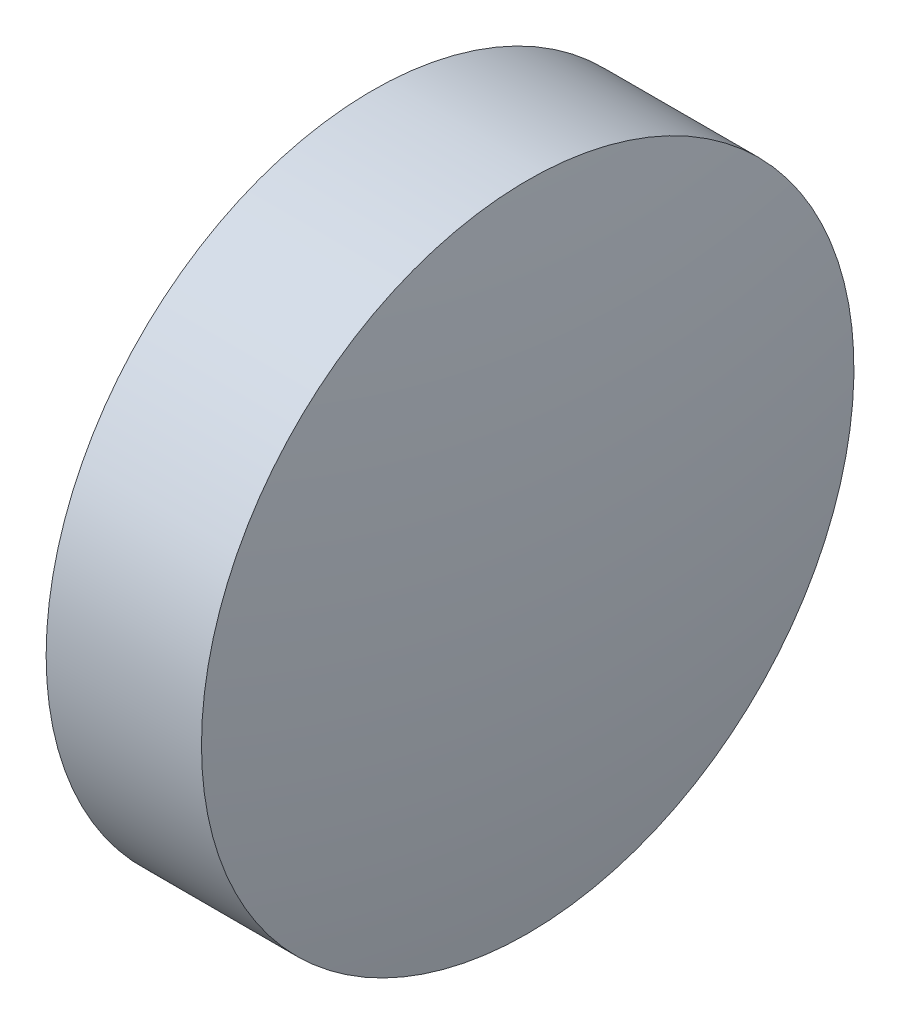
ISO-10303-21;
HEADER;
FILE_DESCRIPTION(('STEP AP214'),'2;1');
FILE_NAME('part.step','',(''),(''),'','','');
FILE_SCHEMA(('AUTOMOTIVE_DESIGN { 1 0 10303 214 1 1 1 1 }'));
ENDSEC;
DATA;
#1=APPLICATION_CONTEXT('core data for automotive mechanical design processes');
#2=APPLICATION_PROTOCOL_DEFINITION('international standard','automotive_design',2000,#1);
#3=PRODUCT_CONTEXT('',#1,'mechanical');
#4=PRODUCT('Part','Part','',(#3));
#5=PRODUCT_RELATED_PRODUCT_CATEGORY('part','',(#4));
#6=PRODUCT_DEFINITION_FORMATION('','',#4);
#7=PRODUCT_DEFINITION_CONTEXT('part definition',#1,'design');
#8=PRODUCT_DEFINITION('design','',#6,#7);
#9=PRODUCT_DEFINITION_SHAPE('','',#8);
#10=(LENGTH_UNIT() NAMED_UNIT(*) SI_UNIT(.MILLI.,.METRE.));
#11=(NAMED_UNIT(*) PLANE_ANGLE_UNIT() SI_UNIT($,.RADIAN.));
#12=(NAMED_UNIT(*) SI_UNIT($,.STERADIAN.) SOLID_ANGLE_UNIT());
#13=UNCERTAINTY_MEASURE_WITH_UNIT(LENGTH_MEASURE(1.E-05),#10,'distance_accuracy_value','');
#14=(GEOMETRIC_REPRESENTATION_CONTEXT(3) GLOBAL_UNCERTAINTY_ASSIGNED_CONTEXT((#13)) GLOBAL_UNIT_ASSIGNED_CONTEXT((#10,
#11,#12)) REPRESENTATION_CONTEXT('',''));
#15=CARTESIAN_POINT('',(0.,0.,0.));
#16=DIRECTION('',(0.,0.,1.));
#17=DIRECTION('',(1.,0.,0.));
#18=AXIS2_PLACEMENT_3D('',#15,#16,#17);
#19=CARTESIAN_POINT('',(427.544406445622,32.7415277501128,0.));
#20=DIRECTION('',(-1.,0.,0.));
#21=DIRECTION('',(0.,-1.,0.));
#22=AXIS2_PLACEMENT_3D('',#19,#20,#21);
#23=SPHERICAL_SURFACE('',#22,18.5100000000001);
#24=CARTESIAN_POINT('',(445.784406445622,32.7415277501127,0.));
#25=DIRECTION('',(-1.,0.,0.));
#26=DIRECTION('',(0.,0.,1.));
#27=AXIS2_PLACEMENT_3D('',#24,#25,#26);
#28=CIRCLE('',#27,3.15);
#29=CARTESIAN_POINT('',(445.784406445622,32.7415277501127,3.15));
#30=VERTEX_POINT('',#29);
#31=EDGE_CURVE('E10',#30,#30,#28,.T.);
#32=ORIENTED_EDGE('',*,*,#31,.F.);
#33=EDGE_LOOP('',(#32));
#34=FACE_BOUND('',#33,.T.);
#35=ADVANCED_FACE('F35',(#34),#23,.T.);
#36=CARTESIAN_POINT('',(443.423768356873,32.7415277501127,0.));
#37=DIRECTION('',(-1.,0.,0.));
#38=DIRECTION('',(0.,0.,1.));
#39=AXIS2_PLACEMENT_3D('',#36,#37,#38);
#40=CYLINDRICAL_SURFACE('',#39,3.15);
#41=CARTESIAN_POINT('',(444.284406445622,32.7415277501127,0.));
#42=DIRECTION('',(-1.,0.,0.));
#43=DIRECTION('',(0.,0.,1.));
#44=AXIS2_PLACEMENT_3D('',#41,#42,#43);
#45=CIRCLE('',#44,3.15);
#46=CARTESIAN_POINT('',(444.284406445622,32.7415277501127,3.15));
#47=VERTEX_POINT('',#46);
#48=EDGE_CURVE('E41',#47,#47,#45,.T.);
#49=ORIENTED_EDGE('',*,*,#48,.F.);
#50=EDGE_LOOP('',(#49));
#51=FACE_BOUND('',#50,.T.);
#52=ORIENTED_EDGE('',*,*,#31,.T.);
#53=EDGE_LOOP('',(#52));
#54=FACE_BOUND('',#53,.T.);
#55=ADVANCED_FACE('F49',(#51,#54),#40,.T.);
#56=CARTESIAN_POINT('',(444.284406445622,32.7415277501127,0.));
#57=DIRECTION('',(1.,0.,0.));
#58=DIRECTION('',(0.,0.,-1.));
#59=AXIS2_PLACEMENT_3D('',#56,#57,#58);
#60=PLANE('',#59);
#61=ORIENTED_EDGE('',*,*,#48,.T.);
#62=EDGE_LOOP('',(#61));
#63=FACE_BOUND('',#62,.T.);
#64=ADVANCED_FACE('F47',(#63),#60,.F.);
#65=CLOSED_SHELL('',(#35,#55,#64));
#66=MANIFOLD_SOLID_BREP('B2',#65);
#67=ADVANCED_BREP_SHAPE_REPRESENTATION('',(#18,#66),#14);
#68=SHAPE_DEFINITION_REPRESENTATION(#9,#67);
ENDSEC;
END-ISO-10303-21;
